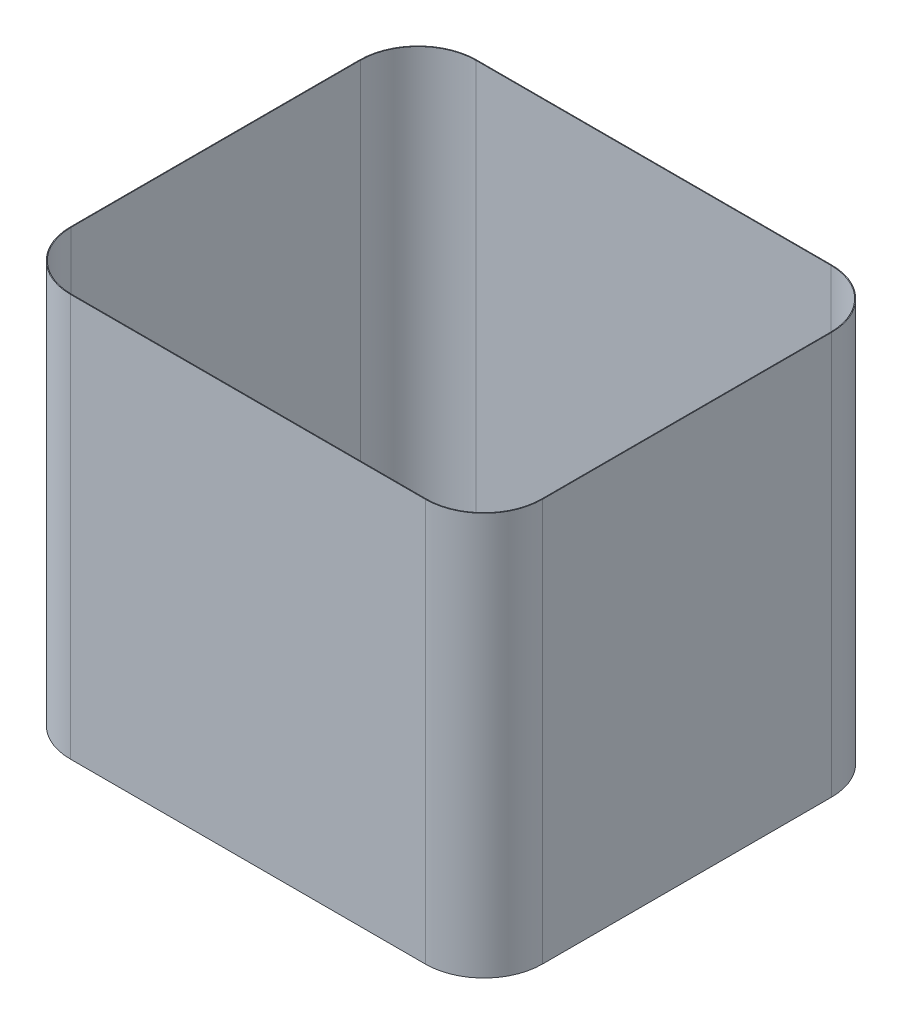
ISO-10303-21;
HEADER;
FILE_DESCRIPTION(('STEP AP214'),'2;1');
FILE_NAME('part.step','',(''),(''),'','','');
FILE_SCHEMA(('AUTOMOTIVE_DESIGN { 1 0 10303 214 1 1 1 1 }'));
ENDSEC;
DATA;
#1=APPLICATION_CONTEXT('core data for automotive mechanical design processes');
#2=APPLICATION_PROTOCOL_DEFINITION('international standard','automotive_design',2000,#1);
#3=PRODUCT_CONTEXT('',#1,'mechanical');
#4=PRODUCT('Part','Part','',(#3));
#5=PRODUCT_RELATED_PRODUCT_CATEGORY('part','',(#4));
#6=PRODUCT_DEFINITION_FORMATION('','',#4);
#7=PRODUCT_DEFINITION_CONTEXT('part definition',#1,'design');
#8=PRODUCT_DEFINITION('design','',#6,#7);
#9=PRODUCT_DEFINITION_SHAPE('','',#8);
#10=(LENGTH_UNIT() NAMED_UNIT(*) SI_UNIT(.MILLI.,.METRE.));
#11=(NAMED_UNIT(*) PLANE_ANGLE_UNIT() SI_UNIT($,.RADIAN.));
#12=(NAMED_UNIT(*) SI_UNIT($,.STERADIAN.) SOLID_ANGLE_UNIT());
#13=UNCERTAINTY_MEASURE_WITH_UNIT(LENGTH_MEASURE(1.E-05),#10,'distance_accuracy_value','');
#14=(GEOMETRIC_REPRESENTATION_CONTEXT(3) GLOBAL_UNCERTAINTY_ASSIGNED_CONTEXT((#13)) GLOBAL_UNIT_ASSIGNED_CONTEXT((#10,
#11,#12)) REPRESENTATION_CONTEXT('',''));
#15=CARTESIAN_POINT('',(0.,0.,0.));
#16=DIRECTION('',(0.,0.,1.));
#17=DIRECTION('',(1.,0.,0.));
#18=AXIS2_PLACEMENT_3D('',#15,#16,#17);
#19=CARTESIAN_POINT('',(-203.2,0.,203.2));
#20=DIRECTION('',(0.,-1.,0.));
#21=DIRECTION('',(0.,0.,-1.));
#22=AXIS2_PLACEMENT_3D('',#19,#20,#21);
#23=PLANE('',#22);
#24=CARTESIAN_POINT('',(-203.2,0.,203.2));
#25=DIRECTION('',(0.,1.,0.));
#26=DIRECTION('',(0.,0.,-1.));
#27=AXIS2_PLACEMENT_3D('',#24,#25,#26);
#28=CIRCLE('',#27,203.2);
#29=CARTESIAN_POINT('',(-406.4,0.,203.199999999999));
#30=VERTEX_POINT('',#29);
#31=CARTESIAN_POINT('',(-203.199999999999,0.,406.4));
#32=VERTEX_POINT('',#31);
#33=EDGE_CURVE('E176',#30,#32,#28,.T.);
#34=ORIENTED_EDGE('',*,*,#33,.F.);
#35=DIRECTION('',(0.,0.,1.));
#36=VECTOR('',#35,1.);
#37=CARTESIAN_POINT('',(-406.4,0.,203.199999999999));
#38=LINE('',#37,#36);
#39=CARTESIAN_POINT('',(-406.4,0.,-800.099999999999));
#40=VERTEX_POINT('',#39);
#41=EDGE_CURVE('E211',#40,#30,#38,.T.);
#42=ORIENTED_EDGE('',*,*,#41,.F.);
#43=CARTESIAN_POINT('',(-203.2,0.,-800.1));
#44=DIRECTION('',(0.,1.,0.));
#45=DIRECTION('',(0.,0.,1.));
#46=AXIS2_PLACEMENT_3D('',#43,#44,#45);
#47=CIRCLE('',#46,203.2);
#48=CARTESIAN_POINT('',(-203.199999999999,0.,-1003.3));
#49=VERTEX_POINT('',#48);
#50=EDGE_CURVE('E238',#49,#40,#47,.T.);
#51=ORIENTED_EDGE('',*,*,#50,.F.);
#52=DIRECTION('',(-1.,0.,0.));
#53=VECTOR('',#52,1.);
#54=CARTESIAN_POINT('',(-203.199999999999,0.,-1003.3));
#55=LINE('',#54,#53);
#56=CARTESIAN_POINT('',(1028.7,0.,-1003.3));
#57=VERTEX_POINT('',#56);
#58=EDGE_CURVE('E236',#57,#49,#55,.T.);
#59=ORIENTED_EDGE('',*,*,#58,.F.);
#60=CARTESIAN_POINT('',(1028.7,0.,-800.1));
#61=DIRECTION('',(0.,1.,0.));
#62=DIRECTION('',(0.,0.,1.));
#63=AXIS2_PLACEMENT_3D('',#60,#61,#62);
#64=CIRCLE('',#63,203.2);
#65=CARTESIAN_POINT('',(1231.9,0.,-800.099999999998));
#66=VERTEX_POINT('',#65);
#67=EDGE_CURVE('E234',#66,#57,#64,.T.);
#68=ORIENTED_EDGE('',*,*,#67,.F.);
#69=DIRECTION('',(0.,0.,-1.));
#70=VECTOR('',#69,1.);
#71=CARTESIAN_POINT('',(1231.9,0.,203.199999999999));
#72=LINE('',#71,#70);
#73=CARTESIAN_POINT('',(1231.9,0.,203.199999999999));
#74=VERTEX_POINT('',#73);
#75=EDGE_CURVE('E232',#74,#66,#72,.T.);
#76=ORIENTED_EDGE('',*,*,#75,.F.);
#77=CARTESIAN_POINT('',(1028.7,0.,203.2));
#78=DIRECTION('',(0.,1.,0.));
#79=DIRECTION('',(0.,0.,1.));
#80=AXIS2_PLACEMENT_3D('',#77,#78,#79);
#81=CIRCLE('',#80,203.2);
#82=CARTESIAN_POINT('',(1028.7,0.,406.4));
#83=VERTEX_POINT('',#82);
#84=EDGE_CURVE('E230',#83,#74,#81,.T.);
#85=ORIENTED_EDGE('',*,*,#84,.F.);
#86=DIRECTION('',(1.,0.,0.));
#87=VECTOR('',#86,1.);
#88=CARTESIAN_POINT('',(-203.199999999999,0.,406.4));
#89=LINE('',#88,#87);
#90=EDGE_CURVE('E228',#32,#83,#89,.T.);
#91=ORIENTED_EDGE('',*,*,#90,.F.);
#92=EDGE_LOOP('',(#34,#42,#51,#59,#68,#76,#85,#91));
#93=FACE_BOUND('',#92,.T.);
#94=DIRECTION('',(0.,0.,1.));
#95=VECTOR('',#94,1.);
#96=CARTESIAN_POINT('',(-403.86,0.,203.2));
#97=LINE('',#96,#95);
#98=CARTESIAN_POINT('',(-403.86,0.,-800.099999999998));
#99=VERTEX_POINT('',#98);
#100=CARTESIAN_POINT('',(-403.86,0.,203.199999999999));
#101=VERTEX_POINT('',#100);
#102=EDGE_CURVE('E157',#99,#101,#97,.T.);
#103=ORIENTED_EDGE('',*,*,#102,.T.);
#104=CARTESIAN_POINT('',(-203.2,0.,203.2));
#105=DIRECTION('',(0.,-1.,0.));
#106=DIRECTION('',(0.,0.,-1.));
#107=AXIS2_PLACEMENT_3D('',#104,#105,#106);
#108=CIRCLE('',#107,200.66);
#109=CARTESIAN_POINT('',(-203.199999999999,0.,403.86));
#110=VERTEX_POINT('',#109);
#111=EDGE_CURVE('E155',#101,#110,#108,.F.);
#112=ORIENTED_EDGE('',*,*,#111,.T.);
#113=DIRECTION('',(1.,0.,0.));
#114=VECTOR('',#113,1.);
#115=CARTESIAN_POINT('',(-203.2,0.,403.86));
#116=LINE('',#115,#114);
#117=CARTESIAN_POINT('',(1028.7,0.,403.86));
#118=VERTEX_POINT('',#117);
#119=EDGE_CURVE('E190',#110,#118,#116,.T.);
#120=ORIENTED_EDGE('',*,*,#119,.T.);
#121=CARTESIAN_POINT('',(1028.7,0.,203.2));
#122=DIRECTION('',(0.,-1.,0.));
#123=DIRECTION('',(0.,0.,-1.));
#124=AXIS2_PLACEMENT_3D('',#121,#122,#123);
#125=CIRCLE('',#124,200.66);
#126=CARTESIAN_POINT('',(1229.36,0.,203.199999999999));
#127=VERTEX_POINT('',#126);
#128=EDGE_CURVE('E57',#118,#127,#125,.F.);
#129=ORIENTED_EDGE('',*,*,#128,.T.);
#130=DIRECTION('',(0.,0.,-1.));
#131=VECTOR('',#130,1.);
#132=CARTESIAN_POINT('',(1229.36,0.,203.2));
#133=LINE('',#132,#131);
#134=CARTESIAN_POINT('',(1229.36,0.,-800.099999999998));
#135=VERTEX_POINT('',#134);
#136=EDGE_CURVE('E201',#127,#135,#133,.T.);
#137=ORIENTED_EDGE('',*,*,#136,.T.);
#138=CARTESIAN_POINT('',(1028.7,0.,-800.1));
#139=DIRECTION('',(0.,-1.,0.));
#140=DIRECTION('',(0.,0.,-1.));
#141=AXIS2_PLACEMENT_3D('',#138,#139,#140);
#142=CIRCLE('',#141,200.66);
#143=CARTESIAN_POINT('',(1028.7,0.,-1000.76));
#144=VERTEX_POINT('',#143);
#145=EDGE_CURVE('E198',#135,#144,#142,.F.);
#146=ORIENTED_EDGE('',*,*,#145,.T.);
#147=DIRECTION('',(-1.,0.,0.));
#148=VECTOR('',#147,1.);
#149=CARTESIAN_POINT('',(-203.2,0.,-1000.76));
#150=LINE('',#149,#148);
#151=CARTESIAN_POINT('',(-203.199999999999,0.,-1000.76));
#152=VERTEX_POINT('',#151);
#153=EDGE_CURVE('E195',#144,#152,#150,.T.);
#154=ORIENTED_EDGE('',*,*,#153,.T.);
#155=CARTESIAN_POINT('',(-203.2,0.,-800.1));
#156=DIRECTION('',(0.,-1.,0.));
#157=DIRECTION('',(0.,0.,-1.));
#158=AXIS2_PLACEMENT_3D('',#155,#156,#157);
#159=CIRCLE('',#158,200.66);
#160=EDGE_CURVE('E192',#152,#99,#159,.F.);
#161=ORIENTED_EDGE('',*,*,#160,.T.);
#162=EDGE_LOOP('',(#103,#112,#120,#129,#137,#146,#154,#161));
#163=FACE_BOUND('',#162,.T.);
#164=ADVANCED_FACE('F34',(#93,#163),#23,.T.);
#165=CARTESIAN_POINT('',(-203.2,1397.,203.2));
#166=DIRECTION('',(0.,-1.,0.));
#167=DIRECTION('',(0.,0.,-1.));
#168=AXIS2_PLACEMENT_3D('',#165,#166,#167);
#169=CYLINDRICAL_SURFACE('',#168,203.2);
#170=ORIENTED_EDGE('',*,*,#33,.T.);
#171=DIRECTION('',(0.,-1.,0.));
#172=VECTOR('',#171,1.);
#173=CARTESIAN_POINT('',(-203.199999999999,1397.,406.4));
#174=LINE('',#173,#172);
#175=CARTESIAN_POINT('',(-203.199999999999,1397.,406.4));
#176=VERTEX_POINT('',#175);
#177=EDGE_CURVE('E11',#176,#32,#174,.T.);
#178=ORIENTED_EDGE('',*,*,#177,.F.);
#179=CARTESIAN_POINT('',(-203.2,1397.,203.2));
#180=DIRECTION('',(0.,1.,0.));
#181=DIRECTION('',(0.,0.,-1.));
#182=AXIS2_PLACEMENT_3D('',#179,#180,#181);
#183=CIRCLE('',#182,203.2);
#184=CARTESIAN_POINT('',(-406.4,1397.,203.199999999999));
#185=VERTEX_POINT('',#184);
#186=EDGE_CURVE('E207',#185,#176,#183,.T.);
#187=ORIENTED_EDGE('',*,*,#186,.F.);
#188=DIRECTION('',(0.,-1.,0.));
#189=VECTOR('',#188,1.);
#190=CARTESIAN_POINT('',(-406.4,1397.,203.199999999999));
#191=LINE('',#190,#189);
#192=EDGE_CURVE('E225',#185,#30,#191,.T.);
#193=ORIENTED_EDGE('',*,*,#192,.T.);
#194=EDGE_LOOP('',(#170,#178,#187,#193));
#195=FACE_BOUND('',#194,.T.);
#196=ADVANCED_FACE('F36',(#195),#169,.T.);
#197=CARTESIAN_POINT('',(-203.199999999999,1397.,406.4));
#198=DIRECTION('',(0.,0.,-1.));
#199=DIRECTION('',(-1.,0.,0.));
#200=AXIS2_PLACEMENT_3D('',#197,#198,#199);
#201=PLANE('',#200);
#202=ORIENTED_EDGE('',*,*,#90,.T.);
#203=DIRECTION('',(0.,-1.,0.));
#204=VECTOR('',#203,1.);
#205=CARTESIAN_POINT('',(1028.7,1397.,406.4));
#206=LINE('',#205,#204);
#207=CARTESIAN_POINT('',(1028.7,1397.,406.4));
#208=VERTEX_POINT('',#207);
#209=EDGE_CURVE('E42',#208,#83,#206,.T.);
#210=ORIENTED_EDGE('',*,*,#209,.F.);
#211=DIRECTION('',(1.,0.,0.));
#212=VECTOR('',#211,1.);
#213=CARTESIAN_POINT('',(-203.199999999999,1397.,406.4));
#214=LINE('',#213,#212);
#215=EDGE_CURVE('E210',#176,#208,#214,.T.);
#216=ORIENTED_EDGE('',*,*,#215,.F.);
#217=ORIENTED_EDGE('',*,*,#177,.T.);
#218=EDGE_LOOP('',(#202,#210,#216,#217));
#219=FACE_BOUND('',#218,.T.);
#220=ADVANCED_FACE('F283',(#219),#201,.F.);
#221=CARTESIAN_POINT('',(1028.7,1397.,203.2));
#222=DIRECTION('',(0.,-1.,0.));
#223=DIRECTION('',(0.,0.,-1.));
#224=AXIS2_PLACEMENT_3D('',#221,#222,#223);
#225=CYLINDRICAL_SURFACE('',#224,203.2);
#226=ORIENTED_EDGE('',*,*,#84,.T.);
#227=DIRECTION('',(0.,-1.,0.));
#228=VECTOR('',#227,1.);
#229=CARTESIAN_POINT('',(1231.9,1397.,203.199999999999));
#230=LINE('',#229,#228);
#231=CARTESIAN_POINT('',(1231.9,1397.,203.199999999999));
#232=VERTEX_POINT('',#231);
#233=EDGE_CURVE('E255',#232,#74,#230,.T.);
#234=ORIENTED_EDGE('',*,*,#233,.F.);
#235=CARTESIAN_POINT('',(1028.7,1397.,203.2));
#236=DIRECTION('',(0.,1.,0.));
#237=DIRECTION('',(0.,0.,1.));
#238=AXIS2_PLACEMENT_3D('',#235,#236,#237);
#239=CIRCLE('',#238,203.2);
#240=EDGE_CURVE('E213',#208,#232,#239,.T.);
#241=ORIENTED_EDGE('',*,*,#240,.F.);
#242=ORIENTED_EDGE('',*,*,#209,.T.);
#243=EDGE_LOOP('',(#226,#234,#241,#242));
#244=FACE_BOUND('',#243,.T.);
#245=ADVANCED_FACE('F262',(#244),#225,.T.);
#246=CARTESIAN_POINT('',(1231.9,1397.,203.199999999999));
#247=DIRECTION('',(-1.,0.,0.));
#248=DIRECTION('',(0.,0.,1.));
#249=AXIS2_PLACEMENT_3D('',#246,#247,#248);
#250=PLANE('',#249);
#251=ORIENTED_EDGE('',*,*,#75,.T.);
#252=DIRECTION('',(0.,-1.,0.));
#253=VECTOR('',#252,1.);
#254=CARTESIAN_POINT('',(1231.9,1397.,-800.099999999998));
#255=LINE('',#254,#253);
#256=CARTESIAN_POINT('',(1231.9,1397.,-800.099999999998));
#257=VERTEX_POINT('',#256);
#258=EDGE_CURVE('E252',#257,#66,#255,.T.);
#259=ORIENTED_EDGE('',*,*,#258,.F.);
#260=DIRECTION('',(0.,0.,-1.));
#261=VECTOR('',#260,1.);
#262=CARTESIAN_POINT('',(1231.9,1397.,203.199999999999));
#263=LINE('',#262,#261);
#264=EDGE_CURVE('E215',#232,#257,#263,.T.);
#265=ORIENTED_EDGE('',*,*,#264,.F.);
#266=ORIENTED_EDGE('',*,*,#233,.T.);
#267=EDGE_LOOP('',(#251,#259,#265,#266));
#268=FACE_BOUND('',#267,.T.);
#269=ADVANCED_FACE('F273',(#268),#250,.F.);
#270=CARTESIAN_POINT('',(1028.7,1397.,-800.1));
#271=DIRECTION('',(0.,-1.,0.));
#272=DIRECTION('',(0.,0.,-1.));
#273=AXIS2_PLACEMENT_3D('',#270,#271,#272);
#274=CYLINDRICAL_SURFACE('',#273,203.2);
#275=ORIENTED_EDGE('',*,*,#67,.T.);
#276=DIRECTION('',(0.,-1.,0.));
#277=VECTOR('',#276,1.);
#278=CARTESIAN_POINT('',(1028.7,1397.,-1003.3));
#279=LINE('',#278,#277);
#280=CARTESIAN_POINT('',(1028.7,1397.,-1003.3));
#281=VERTEX_POINT('',#280);
#282=EDGE_CURVE('E249',#281,#57,#279,.T.);
#283=ORIENTED_EDGE('',*,*,#282,.F.);
#284=CARTESIAN_POINT('',(1028.7,1397.,-800.1));
#285=DIRECTION('',(0.,1.,0.));
#286=DIRECTION('',(0.,0.,1.));
#287=AXIS2_PLACEMENT_3D('',#284,#285,#286);
#288=CIRCLE('',#287,203.2);
#289=EDGE_CURVE('E217',#257,#281,#288,.T.);
#290=ORIENTED_EDGE('',*,*,#289,.F.);
#291=ORIENTED_EDGE('',*,*,#258,.T.);
#292=EDGE_LOOP('',(#275,#283,#290,#291));
#293=FACE_BOUND('',#292,.T.);
#294=ADVANCED_FACE('F277',(#293),#274,.T.);
#295=CARTESIAN_POINT('',(-203.199999999999,1397.,-1003.3));
#296=DIRECTION('',(0.,0.,1.));
#297=DIRECTION('',(1.,0.,0.));
#298=AXIS2_PLACEMENT_3D('',#295,#296,#297);
#299=PLANE('',#298);
#300=ORIENTED_EDGE('',*,*,#58,.T.);
#301=DIRECTION('',(0.,-1.,0.));
#302=VECTOR('',#301,1.);
#303=CARTESIAN_POINT('',(-203.199999999999,1397.,-1003.3));
#304=LINE('',#303,#302);
#305=CARTESIAN_POINT('',(-203.199999999999,1397.,-1003.3));
#306=VERTEX_POINT('',#305);
#307=EDGE_CURVE('E246',#306,#49,#304,.T.);
#308=ORIENTED_EDGE('',*,*,#307,.F.);
#309=DIRECTION('',(-1.,0.,0.));
#310=VECTOR('',#309,1.);
#311=CARTESIAN_POINT('',(-203.199999999999,1397.,-1003.3));
#312=LINE('',#311,#310);
#313=EDGE_CURVE('E219',#281,#306,#312,.T.);
#314=ORIENTED_EDGE('',*,*,#313,.F.);
#315=ORIENTED_EDGE('',*,*,#282,.T.);
#316=EDGE_LOOP('',(#300,#308,#314,#315));
#317=FACE_BOUND('',#316,.T.);
#318=ADVANCED_FACE('F296',(#317),#299,.F.);
#319=CARTESIAN_POINT('',(-203.2,1397.,-800.1));
#320=DIRECTION('',(0.,-1.,0.));
#321=DIRECTION('',(0.,0.,-1.));
#322=AXIS2_PLACEMENT_3D('',#319,#320,#321);
#323=CYLINDRICAL_SURFACE('',#322,203.2);
#324=ORIENTED_EDGE('',*,*,#50,.T.);
#325=DIRECTION('',(0.,-1.,0.));
#326=VECTOR('',#325,1.);
#327=CARTESIAN_POINT('',(-406.4,1397.,-800.099999999999));
#328=LINE('',#327,#326);
#329=CARTESIAN_POINT('',(-406.4,1397.,-800.099999999999));
#330=VERTEX_POINT('',#329);
#331=EDGE_CURVE('E243',#330,#40,#328,.T.);
#332=ORIENTED_EDGE('',*,*,#331,.F.);
#333=CARTESIAN_POINT('',(-203.2,1397.,-800.1));
#334=DIRECTION('',(0.,1.,0.));
#335=DIRECTION('',(0.,0.,1.));
#336=AXIS2_PLACEMENT_3D('',#333,#334,#335);
#337=CIRCLE('',#336,203.2);
#338=EDGE_CURVE('E221',#306,#330,#337,.T.);
#339=ORIENTED_EDGE('',*,*,#338,.F.);
#340=ORIENTED_EDGE('',*,*,#307,.T.);
#341=EDGE_LOOP('',(#324,#332,#339,#340));
#342=FACE_BOUND('',#341,.T.);
#343=ADVANCED_FACE('F294',(#342),#323,.T.);
#344=CARTESIAN_POINT('',(-406.4,1397.,203.199999999999));
#345=DIRECTION('',(1.,0.,0.));
#346=DIRECTION('',(0.,0.,-1.));
#347=AXIS2_PLACEMENT_3D('',#344,#345,#346);
#348=PLANE('',#347);
#349=ORIENTED_EDGE('',*,*,#41,.T.);
#350=ORIENTED_EDGE('',*,*,#192,.F.);
#351=DIRECTION('',(0.,0.,1.));
#352=VECTOR('',#351,1.);
#353=CARTESIAN_POINT('',(-406.4,1397.,203.199999999999));
#354=LINE('',#353,#352);
#355=EDGE_CURVE('E223',#330,#185,#354,.T.);
#356=ORIENTED_EDGE('',*,*,#355,.F.);
#357=ORIENTED_EDGE('',*,*,#331,.T.);
#358=EDGE_LOOP('',(#349,#350,#356,#357));
#359=FACE_BOUND('',#358,.T.);
#360=ADVANCED_FACE('F289',(#359),#348,.F.);
#361=CARTESIAN_POINT('',(-203.2,1397.,203.2));
#362=DIRECTION('',(0.,-1.,0.));
#363=DIRECTION('',(0.,0.,-1.));
#364=AXIS2_PLACEMENT_3D('',#361,#362,#363);
#365=PLANE('',#364);
#366=DIRECTION('',(1.,0.,0.));
#367=VECTOR('',#366,1.);
#368=CARTESIAN_POINT('',(1028.7,1397.,403.86));
#369=LINE('',#368,#367);
#370=CARTESIAN_POINT('',(-203.199999999999,1397.,403.86));
#371=VERTEX_POINT('',#370);
#372=CARTESIAN_POINT('',(1028.7,1397.,403.86));
#373=VERTEX_POINT('',#372);
#374=EDGE_CURVE('E169',#371,#373,#369,.T.);
#375=ORIENTED_EDGE('',*,*,#374,.F.);
#376=CARTESIAN_POINT('',(-203.2,1397.,203.2));
#377=DIRECTION('',(0.,-1.,0.));
#378=DIRECTION('',(0.,0.,-1.));
#379=AXIS2_PLACEMENT_3D('',#376,#377,#378);
#380=CIRCLE('',#379,200.66);
#381=CARTESIAN_POINT('',(-403.86,1397.,203.199999999999));
#382=VERTEX_POINT('',#381);
#383=EDGE_CURVE('E152',#382,#371,#380,.F.);
#384=ORIENTED_EDGE('',*,*,#383,.F.);
#385=DIRECTION('',(0.,0.,1.));
#386=VECTOR('',#385,1.);
#387=CARTESIAN_POINT('',(-403.86,1397.,203.199999999999));
#388=LINE('',#387,#386);
#389=CARTESIAN_POINT('',(-403.86,1397.,-800.099999999998));
#390=VERTEX_POINT('',#389);
#391=EDGE_CURVE('E160',#390,#382,#388,.T.);
#392=ORIENTED_EDGE('',*,*,#391,.F.);
#393=CARTESIAN_POINT('',(-203.2,1397.,-800.1));
#394=DIRECTION('',(0.,-1.,0.));
#395=DIRECTION('',(0.,0.,-1.));
#396=AXIS2_PLACEMENT_3D('',#393,#394,#395);
#397=CIRCLE('',#396,200.66);
#398=CARTESIAN_POINT('',(-203.199999999999,1397.,-1000.76));
#399=VERTEX_POINT('',#398);
#400=EDGE_CURVE('E483',#399,#390,#397,.F.);
#401=ORIENTED_EDGE('',*,*,#400,.F.);
#402=DIRECTION('',(-1.,0.,0.));
#403=VECTOR('',#402,1.);
#404=CARTESIAN_POINT('',(-203.199999999999,1397.,-1000.76));
#405=LINE('',#404,#403);
#406=CARTESIAN_POINT('',(1028.7,1397.,-1000.76));
#407=VERTEX_POINT('',#406);
#408=EDGE_CURVE('E480',#407,#399,#405,.T.);
#409=ORIENTED_EDGE('',*,*,#408,.F.);
#410=CARTESIAN_POINT('',(1028.7,1397.,-800.1));
#411=DIRECTION('',(0.,-1.,0.));
#412=DIRECTION('',(0.,0.,-1.));
#413=AXIS2_PLACEMENT_3D('',#410,#411,#412);
#414=CIRCLE('',#413,200.66);
#415=CARTESIAN_POINT('',(1229.36,1397.,-800.1));
#416=VERTEX_POINT('',#415);
#417=EDGE_CURVE('E482',#416,#407,#414,.F.);
#418=ORIENTED_EDGE('',*,*,#417,.F.);
#419=DIRECTION('',(0.,0.,-1.));
#420=VECTOR('',#419,1.);
#421=CARTESIAN_POINT('',(1229.36,1397.,-800.1));
#422=LINE('',#421,#420);
#423=CARTESIAN_POINT('',(1229.36,1397.,203.199999999999));
#424=VERTEX_POINT('',#423);
#425=EDGE_CURVE('E488',#424,#416,#422,.T.);
#426=ORIENTED_EDGE('',*,*,#425,.F.);
#427=CARTESIAN_POINT('',(1028.7,1397.,203.2));
#428=DIRECTION('',(0.,-1.,0.));
#429=DIRECTION('',(0.,0.,-1.));
#430=AXIS2_PLACEMENT_3D('',#427,#428,#429);
#431=CIRCLE('',#430,200.66);
#432=EDGE_CURVE('E171',#373,#424,#431,.F.);
#433=ORIENTED_EDGE('',*,*,#432,.F.);
#434=EDGE_LOOP('',(#375,#384,#392,#401,#409,#418,#426,#433));
#435=FACE_BOUND('',#434,.T.);
#436=ORIENTED_EDGE('',*,*,#186,.T.);
#437=ORIENTED_EDGE('',*,*,#215,.T.);
#438=ORIENTED_EDGE('',*,*,#240,.T.);
#439=ORIENTED_EDGE('',*,*,#264,.T.);
#440=ORIENTED_EDGE('',*,*,#289,.T.);
#441=ORIENTED_EDGE('',*,*,#313,.T.);
#442=ORIENTED_EDGE('',*,*,#338,.T.);
#443=ORIENTED_EDGE('',*,*,#355,.T.);
#444=EDGE_LOOP('',(#436,#437,#438,#439,#440,#441,#442,#443));
#445=FACE_BOUND('',#444,.T.);
#446=ADVANCED_FACE('F165',(#435,#445),#365,.F.);
#447=CARTESIAN_POINT('',(-203.2,1397.,203.2));
#448=DIRECTION('',(0.,-1.,0.));
#449=DIRECTION('',(0.,0.,-1.));
#450=AXIS2_PLACEMENT_3D('',#447,#448,#449);
#451=CYLINDRICAL_SURFACE('',#450,200.66);
#452=ORIENTED_EDGE('',*,*,#111,.F.);
#453=DIRECTION('',(0.,-1.,0.));
#454=VECTOR('',#453,1.);
#455=CARTESIAN_POINT('',(-403.86,1397.,203.199999999999));
#456=LINE('',#455,#454);
#457=EDGE_CURVE('E148',#382,#101,#456,.T.);
#458=ORIENTED_EDGE('',*,*,#457,.F.);
#459=ORIENTED_EDGE('',*,*,#383,.T.);
#460=DIRECTION('',(0.,1.,0.));
#461=VECTOR('',#460,1.);
#462=CARTESIAN_POINT('',(-203.199999999999,1397.,403.86));
#463=LINE('',#462,#461);
#464=EDGE_CURVE('E175',#371,#110,#463,.F.);
#465=ORIENTED_EDGE('',*,*,#464,.T.);
#466=EDGE_LOOP('',(#452,#458,#459,#465));
#467=FACE_BOUND('',#466,.T.);
#468=ADVANCED_FACE('F149',(#467),#451,.F.);
#469=CARTESIAN_POINT('',(-203.199999999999,1397.,403.86));
#470=DIRECTION('',(0.,0.,-1.));
#471=DIRECTION('',(-1.,0.,0.));
#472=AXIS2_PLACEMENT_3D('',#469,#470,#471);
#473=PLANE('',#472);
#474=ORIENTED_EDGE('',*,*,#119,.F.);
#475=ORIENTED_EDGE('',*,*,#464,.F.);
#476=ORIENTED_EDGE('',*,*,#374,.T.);
#477=DIRECTION('',(0.,-1.,0.));
#478=VECTOR('',#477,1.);
#479=CARTESIAN_POINT('',(1028.7,1397.,403.86));
#480=LINE('',#479,#478);
#481=EDGE_CURVE('E177',#373,#118,#480,.T.);
#482=ORIENTED_EDGE('',*,*,#481,.T.);
#483=EDGE_LOOP('',(#474,#475,#476,#482));
#484=FACE_BOUND('',#483,.T.);
#485=ADVANCED_FACE('F320',(#484),#473,.T.);
#486=CARTESIAN_POINT('',(1028.7,1397.,203.2));
#487=DIRECTION('',(0.,-1.,0.));
#488=DIRECTION('',(0.,0.,-1.));
#489=AXIS2_PLACEMENT_3D('',#486,#487,#488);
#490=CYLINDRICAL_SURFACE('',#489,200.66);
#491=ORIENTED_EDGE('',*,*,#128,.F.);
#492=ORIENTED_EDGE('',*,*,#481,.F.);
#493=ORIENTED_EDGE('',*,*,#432,.T.);
#494=DIRECTION('',(0.,1.,0.));
#495=VECTOR('',#494,1.);
#496=CARTESIAN_POINT('',(1229.36,1397.,203.199999999999));
#497=LINE('',#496,#495);
#498=EDGE_CURVE('E180',#424,#127,#497,.F.);
#499=ORIENTED_EDGE('',*,*,#498,.T.);
#500=EDGE_LOOP('',(#491,#492,#493,#499));
#501=FACE_BOUND('',#500,.T.);
#502=ADVANCED_FACE('F325',(#501),#490,.F.);
#503=CARTESIAN_POINT('',(1229.36,1397.,203.199999999999));
#504=DIRECTION('',(-1.,0.,0.));
#505=DIRECTION('',(0.,0.,1.));
#506=AXIS2_PLACEMENT_3D('',#503,#504,#505);
#507=PLANE('',#506);
#508=ORIENTED_EDGE('',*,*,#136,.F.);
#509=ORIENTED_EDGE('',*,*,#498,.F.);
#510=ORIENTED_EDGE('',*,*,#425,.T.);
#511=DIRECTION('',(0.,-1.,0.));
#512=VECTOR('',#511,1.);
#513=CARTESIAN_POINT('',(1229.36,1397.,-800.099999999998));
#514=LINE('',#513,#512);
#515=EDGE_CURVE('E182',#416,#135,#514,.T.);
#516=ORIENTED_EDGE('',*,*,#515,.T.);
#517=EDGE_LOOP('',(#508,#509,#510,#516));
#518=FACE_BOUND('',#517,.T.);
#519=ADVANCED_FACE('F331',(#518),#507,.T.);
#520=CARTESIAN_POINT('',(1028.7,1397.,-800.1));
#521=DIRECTION('',(0.,-1.,0.));
#522=DIRECTION('',(0.,0.,-1.));
#523=AXIS2_PLACEMENT_3D('',#520,#521,#522);
#524=CYLINDRICAL_SURFACE('',#523,200.66);
#525=ORIENTED_EDGE('',*,*,#145,.F.);
#526=ORIENTED_EDGE('',*,*,#515,.F.);
#527=ORIENTED_EDGE('',*,*,#417,.T.);
#528=DIRECTION('',(0.,1.,0.));
#529=VECTOR('',#528,1.);
#530=CARTESIAN_POINT('',(1028.7,1397.,-1000.76));
#531=LINE('',#530,#529);
#532=EDGE_CURVE('E184',#407,#144,#531,.F.);
#533=ORIENTED_EDGE('',*,*,#532,.T.);
#534=EDGE_LOOP('',(#525,#526,#527,#533));
#535=FACE_BOUND('',#534,.T.);
#536=ADVANCED_FACE('F334',(#535),#524,.F.);
#537=CARTESIAN_POINT('',(-203.199999999999,1397.,-1000.76));
#538=DIRECTION('',(0.,0.,1.));
#539=DIRECTION('',(1.,0.,0.));
#540=AXIS2_PLACEMENT_3D('',#537,#538,#539);
#541=PLANE('',#540);
#542=ORIENTED_EDGE('',*,*,#153,.F.);
#543=ORIENTED_EDGE('',*,*,#532,.F.);
#544=ORIENTED_EDGE('',*,*,#408,.T.);
#545=DIRECTION('',(0.,-1.,0.));
#546=VECTOR('',#545,1.);
#547=CARTESIAN_POINT('',(-203.199999999999,1397.,-1000.76));
#548=LINE('',#547,#546);
#549=EDGE_CURVE('E186',#399,#152,#548,.T.);
#550=ORIENTED_EDGE('',*,*,#549,.T.);
#551=EDGE_LOOP('',(#542,#543,#544,#550));
#552=FACE_BOUND('',#551,.T.);
#553=ADVANCED_FACE('F338',(#552),#541,.T.);
#554=CARTESIAN_POINT('',(-203.2,1397.,-800.1));
#555=DIRECTION('',(0.,-1.,0.));
#556=DIRECTION('',(0.,0.,-1.));
#557=AXIS2_PLACEMENT_3D('',#554,#555,#556);
#558=CYLINDRICAL_SURFACE('',#557,200.66);
#559=ORIENTED_EDGE('',*,*,#160,.F.);
#560=ORIENTED_EDGE('',*,*,#549,.F.);
#561=ORIENTED_EDGE('',*,*,#400,.T.);
#562=DIRECTION('',(0.,1.,0.));
#563=VECTOR('',#562,1.);
#564=CARTESIAN_POINT('',(-403.86,1397.,-800.099999999999));
#565=LINE('',#564,#563);
#566=EDGE_CURVE('E49',#390,#99,#565,.F.);
#567=ORIENTED_EDGE('',*,*,#566,.T.);
#568=EDGE_LOOP('',(#559,#560,#561,#567));
#569=FACE_BOUND('',#568,.T.);
#570=ADVANCED_FACE('F342',(#569),#558,.F.);
#571=CARTESIAN_POINT('',(-403.86,1397.,203.199999999999));
#572=DIRECTION('',(1.,0.,0.));
#573=DIRECTION('',(0.,0.,-1.));
#574=AXIS2_PLACEMENT_3D('',#571,#572,#573);
#575=PLANE('',#574);
#576=ORIENTED_EDGE('',*,*,#102,.F.);
#577=ORIENTED_EDGE('',*,*,#566,.F.);
#578=ORIENTED_EDGE('',*,*,#391,.T.);
#579=ORIENTED_EDGE('',*,*,#457,.T.);
#580=EDGE_LOOP('',(#576,#577,#578,#579));
#581=FACE_BOUND('',#580,.T.);
#582=ADVANCED_FACE('F161',(#581),#575,.T.);
#583=CLOSED_SHELL('',(#164,#196,#220,#245,#269,#294,#318,#343,#360,#446,#468,#485,#502,#519,
#536,#553,#570,#582));
#584=MANIFOLD_SOLID_BREP('B2',#583);
#585=ADVANCED_BREP_SHAPE_REPRESENTATION('',(#18,#584),#14);
#586=SHAPE_DEFINITION_REPRESENTATION(#9,#585);
ENDSEC;
END-ISO-10303-21;
